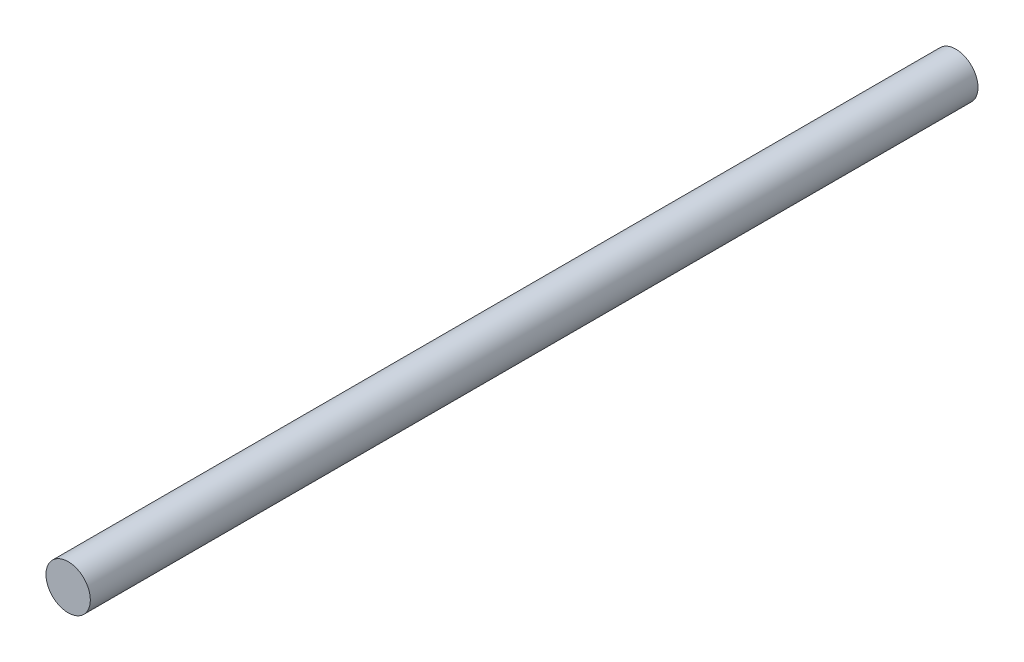
ISO-10303-21;
HEADER;
FILE_DESCRIPTION(('STEP AP214'),'2;1');
FILE_NAME('part.step','',(''),(''),'','','');
FILE_SCHEMA(('AUTOMOTIVE_DESIGN { 1 0 10303 214 1 1 1 1 }'));
ENDSEC;
DATA;
#1=APPLICATION_CONTEXT('core data for automotive mechanical design processes');
#2=APPLICATION_PROTOCOL_DEFINITION('international standard','automotive_design',2000,#1);
#3=PRODUCT_CONTEXT('',#1,'mechanical');
#4=PRODUCT('Part','Part','',(#3));
#5=PRODUCT_RELATED_PRODUCT_CATEGORY('part','',(#4));
#6=PRODUCT_DEFINITION_FORMATION('','',#4);
#7=PRODUCT_DEFINITION_CONTEXT('part definition',#1,'design');
#8=PRODUCT_DEFINITION('design','',#6,#7);
#9=PRODUCT_DEFINITION_SHAPE('','',#8);
#10=(LENGTH_UNIT() NAMED_UNIT(*) SI_UNIT(.MILLI.,.METRE.));
#11=(NAMED_UNIT(*) PLANE_ANGLE_UNIT() SI_UNIT($,.RADIAN.));
#12=(NAMED_UNIT(*) SI_UNIT($,.STERADIAN.) SOLID_ANGLE_UNIT());
#13=UNCERTAINTY_MEASURE_WITH_UNIT(LENGTH_MEASURE(1.E-05),#10,'distance_accuracy_value','');
#14=(GEOMETRIC_REPRESENTATION_CONTEXT(3) GLOBAL_UNCERTAINTY_ASSIGNED_CONTEXT((#13)) GLOBAL_UNIT_ASSIGNED_CONTEXT((#10,
#11,#12)) REPRESENTATION_CONTEXT('',''));
#15=CARTESIAN_POINT('',(0.,0.,0.));
#16=DIRECTION('',(0.,0.,1.));
#17=DIRECTION('',(1.,0.,0.));
#18=AXIS2_PLACEMENT_3D('',#15,#16,#17);
#19=CARTESIAN_POINT('',(0.,0.,50.));
#20=DIRECTION('',(0.,0.,-1.));
#21=DIRECTION('',(-1.,0.,0.));
#22=AXIS2_PLACEMENT_3D('',#19,#20,#21);
#23=CYLINDRICAL_SURFACE('',#22,1.25);
#24=CARTESIAN_POINT('',(0.,0.,50.));
#25=DIRECTION('',(0.,0.,1.));
#26=DIRECTION('',(1.,0.,0.));
#27=AXIS2_PLACEMENT_3D('',#24,#25,#26);
#28=CIRCLE('',#27,1.25);
#29=CARTESIAN_POINT('',(1.25,0.,50.));
#30=VERTEX_POINT('',#29);
#31=EDGE_CURVE('E10',#30,#30,#28,.T.);
#32=ORIENTED_EDGE('',*,*,#31,.F.);
#33=EDGE_LOOP('',(#32));
#34=FACE_BOUND('',#33,.T.);
#35=CARTESIAN_POINT('',(0.,0.,0.));
#36=DIRECTION('',(0.,0.,1.));
#37=DIRECTION('',(1.,0.,0.));
#38=AXIS2_PLACEMENT_3D('',#35,#36,#37);
#39=CIRCLE('',#38,1.25);
#40=CARTESIAN_POINT('',(1.25,0.,0.));
#41=VERTEX_POINT('',#40);
#42=EDGE_CURVE('E36',#41,#41,#39,.T.);
#43=ORIENTED_EDGE('',*,*,#42,.T.);
#44=EDGE_LOOP('',(#43));
#45=FACE_BOUND('',#44,.T.);
#46=ADVANCED_FACE('F33',(#34,#45),#23,.T.);
#47=CARTESIAN_POINT('',(0.,0.,50.));
#48=DIRECTION('',(0.,0.,1.));
#49=DIRECTION('',(1.,0.,0.));
#50=AXIS2_PLACEMENT_3D('',#47,#48,#49);
#51=PLANE('',#50);
#52=ORIENTED_EDGE('',*,*,#31,.T.);
#53=EDGE_LOOP('',(#52));
#54=FACE_BOUND('',#53,.T.);
#55=ADVANCED_FACE('F48',(#54),#51,.T.);
#56=CARTESIAN_POINT('',(0.,0.,0.));
#57=DIRECTION('',(0.,0.,1.));
#58=DIRECTION('',(1.,0.,0.));
#59=AXIS2_PLACEMENT_3D('',#56,#57,#58);
#60=PLANE('',#59);
#61=ORIENTED_EDGE('',*,*,#42,.F.);
#62=EDGE_LOOP('',(#61));
#63=FACE_BOUND('',#62,.T.);
#64=ADVANCED_FACE('F46',(#63),#60,.F.);
#65=CLOSED_SHELL('',(#46,#55,#64));
#66=MANIFOLD_SOLID_BREP('B2',#65);
#67=ADVANCED_BREP_SHAPE_REPRESENTATION('',(#18,#66),#14);
#68=SHAPE_DEFINITION_REPRESENTATION(#9,#67);
ENDSEC;
END-ISO-10303-21;
